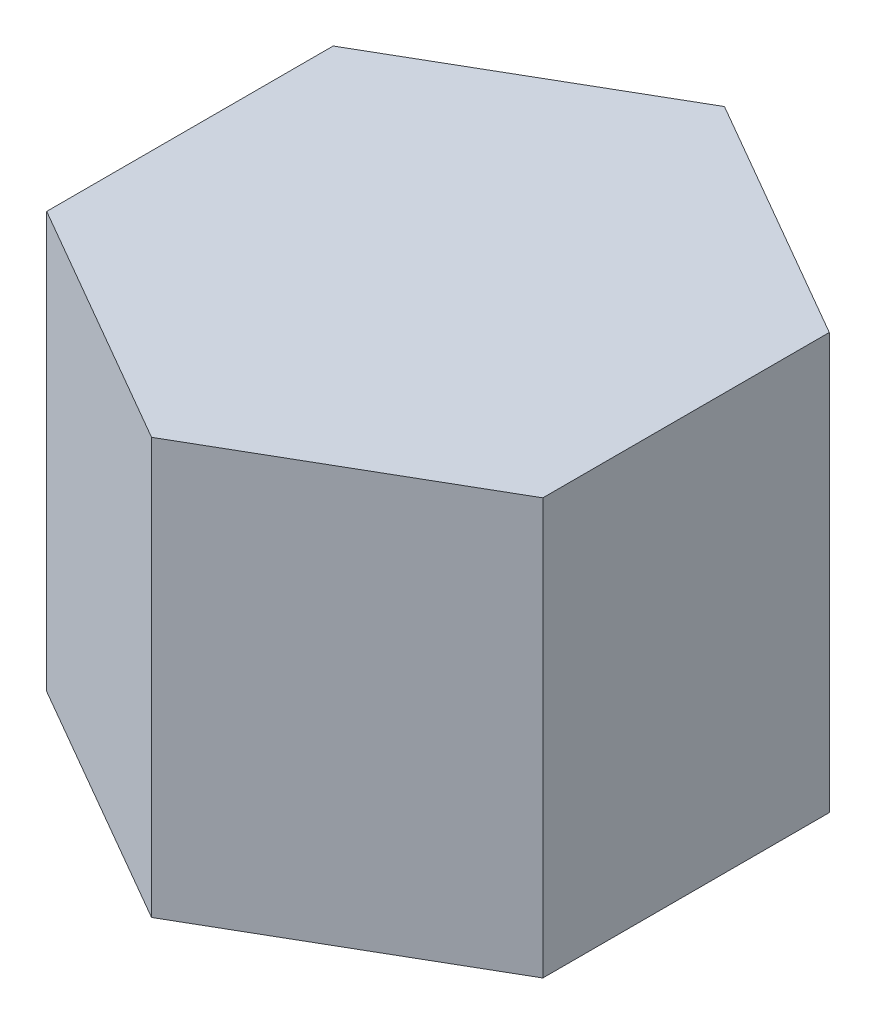
ISO-10303-21;
HEADER;
FILE_DESCRIPTION(('STEP AP214'),'2;1');
FILE_NAME('part.step','',(''),(''),'','','');
FILE_SCHEMA(('AUTOMOTIVE_DESIGN { 1 0 10303 214 1 1 1 1 }'));
ENDSEC;
DATA;
#1=APPLICATION_CONTEXT('core data for automotive mechanical design processes');
#2=APPLICATION_PROTOCOL_DEFINITION('international standard','automotive_design',2000,#1);
#3=PRODUCT_CONTEXT('',#1,'mechanical');
#4=PRODUCT('Part','Part','',(#3));
#5=PRODUCT_RELATED_PRODUCT_CATEGORY('part','',(#4));
#6=PRODUCT_DEFINITION_FORMATION('','',#4);
#7=PRODUCT_DEFINITION_CONTEXT('part definition',#1,'design');
#8=PRODUCT_DEFINITION('design','',#6,#7);
#9=PRODUCT_DEFINITION_SHAPE('','',#8);
#10=(LENGTH_UNIT() NAMED_UNIT(*) SI_UNIT(.MILLI.,.METRE.));
#11=(NAMED_UNIT(*) PLANE_ANGLE_UNIT() SI_UNIT($,.RADIAN.));
#12=(NAMED_UNIT(*) SI_UNIT($,.STERADIAN.) SOLID_ANGLE_UNIT());
#13=UNCERTAINTY_MEASURE_WITH_UNIT(LENGTH_MEASURE(1.E-05),#10,'distance_accuracy_value','');
#14=(GEOMETRIC_REPRESENTATION_CONTEXT(3) GLOBAL_UNCERTAINTY_ASSIGNED_CONTEXT((#13)) GLOBAL_UNIT_ASSIGNED_CONTEXT((#10,
#11,#12)) REPRESENTATION_CONTEXT('',''));
#15=CARTESIAN_POINT('',(0.,0.,0.));
#16=DIRECTION('',(0.,0.,1.));
#17=DIRECTION('',(1.,0.,0.));
#18=AXIS2_PLACEMENT_3D('',#15,#16,#17);
#19=CARTESIAN_POINT('',(211.142660308706,-148.537700895744,287.176844201572));
#20=DIRECTION('',(-0.499999999999943,0.,-0.866025403784472));
#21=DIRECTION('',(-0.866025403784472,0.,0.499999999999943));
#22=AXIS2_PLACEMENT_3D('',#19,#20,#21);
#23=PLANE('',#22);
#24=CARTESIAN_POINT('',(210.839551417382,-149.045793579175,287.351844201572));
#25=DIRECTION('',(0.866025403784471,0.,-0.499999999999943));
#26=VECTOR('',#25,1.);
#27=LINE('',#24,#26);
#28=CARTESIAN_POINT('',(210.839551417382,-149.045793579175,287.351844201572));
#29=VERTEX_POINT('',#28);
#30=CARTESIAN_POINT('',(211.142660308706,-149.045793579175,287.176844201572));
#31=VERTEX_POINT('',#30);
#32=EDGE_CURVE('E170',#29,#31,#27,.T.);
#33=ORIENTED_EDGE('',*,*,#32,.T.);
#34=CARTESIAN_POINT('',(211.142660308706,-148.537700895744,287.176844201572));
#35=DIRECTION('',(0.,-1.,0.));
#36=VECTOR('',#35,1.);
#37=LINE('',#34,#36);
#38=CARTESIAN_POINT('',(211.142660308706,-148.537700895744,287.176844201572));
#39=VERTEX_POINT('',#38);
#40=EDGE_CURVE('E35',#39,#31,#37,.T.);
#41=ORIENTED_EDGE('',*,*,#40,.F.);
#42=CARTESIAN_POINT('',(210.839551417382,-148.537700895744,287.351844201572));
#43=DIRECTION('',(0.866025403784471,0.,-0.499999999999943));
#44=VECTOR('',#43,1.);
#45=LINE('',#42,#44);
#46=CARTESIAN_POINT('',(210.839551417382,-148.537700895744,287.351844201572));
#47=VERTEX_POINT('',#46);
#48=EDGE_CURVE('E159',#47,#39,#45,.T.);
#49=ORIENTED_EDGE('',*,*,#48,.F.);
#50=CARTESIAN_POINT('',(210.839551417382,-148.537700895744,287.351844201572));
#51=DIRECTION('',(0.,-1.,0.));
#52=VECTOR('',#51,1.);
#53=LINE('',#50,#52);
#54=EDGE_CURVE('E10',#47,#29,#53,.T.);
#55=ORIENTED_EDGE('',*,*,#54,.T.);
#56=EDGE_LOOP('',(#33,#41,#49,#55));
#57=FACE_BOUND('',#56,.T.);
#58=ADVANCED_FACE('F16',(#57),#23,.F.);
#59=CARTESIAN_POINT('',(210.839551417382,-148.537700895744,287.351844201572));
#60=DIRECTION('',(0.500000000000062,0.,-0.866025403784403));
#61=DIRECTION('',(-0.866025403784403,0.,-0.500000000000062));
#62=AXIS2_PLACEMENT_3D('',#59,#60,#61);
#63=PLANE('',#62);
#64=CARTESIAN_POINT('',(210.536442526057,-149.045793579175,287.176844201572));
#65=DIRECTION('',(0.866025403784403,0.,0.500000000000062));
#66=VECTOR('',#65,1.);
#67=LINE('',#64,#66);
#68=CARTESIAN_POINT('',(210.536442526057,-149.045793579175,287.176844201572));
#69=VERTEX_POINT('',#68);
#70=EDGE_CURVE('E167',#69,#29,#67,.T.);
#71=ORIENTED_EDGE('',*,*,#70,.T.);
#72=ORIENTED_EDGE('',*,*,#54,.F.);
#73=CARTESIAN_POINT('',(210.536442526057,-148.537700895744,287.176844201572));
#74=DIRECTION('',(0.866025403784403,0.,0.500000000000062));
#75=VECTOR('',#74,1.);
#76=LINE('',#73,#75);
#77=CARTESIAN_POINT('',(210.536442526057,-148.537700895744,287.176844201572));
#78=VERTEX_POINT('',#77);
#79=EDGE_CURVE('E156',#78,#47,#76,.T.);
#80=ORIENTED_EDGE('',*,*,#79,.F.);
#81=CARTESIAN_POINT('',(210.536442526057,-148.537700895744,287.176844201572));
#82=DIRECTION('',(0.,-1.,0.));
#83=VECTOR('',#82,1.);
#84=LINE('',#81,#83);
#85=EDGE_CURVE('E27',#78,#69,#84,.T.);
#86=ORIENTED_EDGE('',*,*,#85,.T.);
#87=EDGE_LOOP('',(#71,#72,#80,#86));
#88=FACE_BOUND('',#87,.T.);
#89=ADVANCED_FACE('F189',(#88),#63,.F.);
#90=CARTESIAN_POINT('',(210.536442526057,-148.537700895744,290.831971220494));
#91=DIRECTION('',(1.,0.,0.));
#92=DIRECTION('',(0.,1.,0.));
#93=AXIS2_PLACEMENT_3D('',#90,#91,#92);
#94=PLANE('',#93);
#95=CARTESIAN_POINT('',(210.536442526057,-149.045793579175,286.826844201572));
#96=DIRECTION('',(0.,0.,1.));
#97=VECTOR('',#96,1.);
#98=LINE('',#95,#97);
#99=CARTESIAN_POINT('',(210.536442526057,-149.045793579175,286.826844201572));
#100=VERTEX_POINT('',#99);
#101=EDGE_CURVE('E163',#100,#69,#98,.T.);
#102=ORIENTED_EDGE('',*,*,#101,.T.);
#103=ORIENTED_EDGE('',*,*,#85,.F.);
#104=CARTESIAN_POINT('',(210.536442526057,-148.537700895744,286.826844201572));
#105=DIRECTION('',(0.,0.,1.));
#106=VECTOR('',#105,1.);
#107=LINE('',#104,#106);
#108=CARTESIAN_POINT('',(210.536442526057,-148.537700895744,286.826844201572));
#109=VERTEX_POINT('',#108);
#110=EDGE_CURVE('E106',#109,#78,#107,.T.);
#111=ORIENTED_EDGE('',*,*,#110,.F.);
#112=CARTESIAN_POINT('',(210.536442526057,-148.537700895744,286.826844201572));
#113=DIRECTION('',(0.,-1.,0.));
#114=VECTOR('',#113,1.);
#115=LINE('',#112,#114);
#116=EDGE_CURVE('E94',#109,#100,#115,.T.);
#117=ORIENTED_EDGE('',*,*,#116,.T.);
#118=EDGE_LOOP('',(#102,#103,#111,#117));
#119=FACE_BOUND('',#118,.T.);
#120=ADVANCED_FACE('F198',(#119),#94,.F.);
#121=CARTESIAN_POINT('',(210.536442526057,-148.537700895744,286.826844201572));
#122=DIRECTION('',(0.499999999999978,0.,0.866025403784452));
#123=DIRECTION('',(0.866025403784452,0.,-0.499999999999978));
#124=AXIS2_PLACEMENT_3D('',#121,#122,#123);
#125=PLANE('',#124);
#126=CARTESIAN_POINT('',(210.839551417382,-149.045793579175,286.651844201572));
#127=DIRECTION('',(-0.866025403784452,0.,0.499999999999978));
#128=VECTOR('',#127,1.);
#129=LINE('',#126,#128);
#130=CARTESIAN_POINT('',(210.839551417382,-149.045793579175,286.651844201572));
#131=VERTEX_POINT('',#130);
#132=EDGE_CURVE('E162',#131,#100,#129,.T.);
#133=ORIENTED_EDGE('',*,*,#132,.T.);
#134=ORIENTED_EDGE('',*,*,#116,.F.);
#135=CARTESIAN_POINT('',(210.839551417382,-148.537700895744,286.651844201572));
#136=DIRECTION('',(-0.866025403784452,0.,0.499999999999978));
#137=VECTOR('',#136,1.);
#138=LINE('',#135,#137);
#139=CARTESIAN_POINT('',(210.839551417382,-148.537700895744,286.651844201572));
#140=VERTEX_POINT('',#139);
#141=EDGE_CURVE('E98',#140,#109,#138,.T.);
#142=ORIENTED_EDGE('',*,*,#141,.F.);
#143=CARTESIAN_POINT('',(210.839551417382,-148.537700895744,286.651844201572));
#144=DIRECTION('',(0.,-1.,0.));
#145=VECTOR('',#144,1.);
#146=LINE('',#143,#145);
#147=EDGE_CURVE('E79',#140,#131,#146,.T.);
#148=ORIENTED_EDGE('',*,*,#147,.T.);
#149=EDGE_LOOP('',(#133,#134,#142,#148));
#150=FACE_BOUND('',#149,.T.);
#151=ADVANCED_FACE('F100',(#150),#125,.F.);
#152=CARTESIAN_POINT('',(210.839551417382,-148.537700895744,286.651844201572));
#153=DIRECTION('',(-0.499999999999943,0.,0.866025403784472));
#154=DIRECTION('',(0.866025403784472,0.,0.499999999999943));
#155=AXIS2_PLACEMENT_3D('',#152,#153,#154);
#156=PLANE('',#155);
#157=CARTESIAN_POINT('',(211.142660308706,-149.045793579175,286.826844201572));
#158=DIRECTION('',(-0.866025403784471,0.,-0.499999999999943));
#159=VECTOR('',#158,1.);
#160=LINE('',#157,#159);
#161=CARTESIAN_POINT('',(211.142660308706,-149.045793579175,286.826844201572));
#162=VERTEX_POINT('',#161);
#163=EDGE_CURVE('E88',#162,#131,#160,.T.);
#164=ORIENTED_EDGE('',*,*,#163,.T.);
#165=ORIENTED_EDGE('',*,*,#147,.F.);
#166=CARTESIAN_POINT('',(211.142660308706,-148.537700895744,286.826844201572));
#167=DIRECTION('',(-0.866025403784471,0.,-0.499999999999943));
#168=VECTOR('',#167,1.);
#169=LINE('',#166,#168);
#170=CARTESIAN_POINT('',(211.142660308706,-148.537700895744,286.826844201572));
#171=VERTEX_POINT('',#170);
#172=EDGE_CURVE('E84',#171,#140,#169,.T.);
#173=ORIENTED_EDGE('',*,*,#172,.F.);
#174=CARTESIAN_POINT('',(211.142660308706,-148.537700895744,286.826844201572));
#175=DIRECTION('',(0.,-1.,0.));
#176=VECTOR('',#175,1.);
#177=LINE('',#174,#176);
#178=EDGE_CURVE('E58',#171,#162,#177,.T.);
#179=ORIENTED_EDGE('',*,*,#178,.T.);
#180=EDGE_LOOP('',(#164,#165,#173,#179));
#181=FACE_BOUND('',#180,.T.);
#182=ADVANCED_FACE('F82',(#181),#156,.F.);
#183=CARTESIAN_POINT('',(211.142660308706,-148.537700895744,290.831971220494));
#184=DIRECTION('',(-1.,0.,0.));
#185=DIRECTION('',(0.,-1.,0.));
#186=AXIS2_PLACEMENT_3D('',#183,#184,#185);
#187=PLANE('',#186);
#188=CARTESIAN_POINT('',(211.142660308706,-149.045793579175,287.176844201572));
#189=DIRECTION('',(0.,0.,-1.));
#190=VECTOR('',#189,1.);
#191=LINE('',#188,#190);
#192=EDGE_CURVE('E160',#31,#162,#191,.T.);
#193=ORIENTED_EDGE('',*,*,#192,.T.);
#194=ORIENTED_EDGE('',*,*,#178,.F.);
#195=CARTESIAN_POINT('',(211.142660308706,-148.537700895744,287.176844201572));
#196=DIRECTION('',(0.,0.,-1.));
#197=VECTOR('',#196,1.);
#198=LINE('',#195,#197);
#199=EDGE_CURVE('E112',#39,#171,#198,.T.);
#200=ORIENTED_EDGE('',*,*,#199,.F.);
#201=ORIENTED_EDGE('',*,*,#40,.T.);
#202=EDGE_LOOP('',(#193,#194,#200,#201));
#203=FACE_BOUND('',#202,.T.);
#204=ADVANCED_FACE('F131',(#203),#187,.F.);
#205=CARTESIAN_POINT('',(206.339551417382,-148.537700895744,290.831971220494));
#206=DIRECTION('',(0.,-1.,0.));
#207=DIRECTION('',(1.,0.,0.));
#208=AXIS2_PLACEMENT_3D('',#205,#206,#207);
#209=PLANE('',#208);
#210=ORIENTED_EDGE('',*,*,#48,.T.);
#211=ORIENTED_EDGE('',*,*,#199,.T.);
#212=ORIENTED_EDGE('',*,*,#172,.T.);
#213=ORIENTED_EDGE('',*,*,#141,.T.);
#214=ORIENTED_EDGE('',*,*,#110,.T.);
#215=ORIENTED_EDGE('',*,*,#79,.T.);
#216=EDGE_LOOP('',(#210,#211,#212,#213,#214,#215));
#217=FACE_BOUND('',#216,.T.);
#218=ADVANCED_FACE('F111',(#217),#209,.F.);
#219=CARTESIAN_POINT('',(206.339551417382,-149.045793579175,290.831971220494));
#220=DIRECTION('',(0.,-1.,0.));
#221=DIRECTION('',(1.,0.,0.));
#222=AXIS2_PLACEMENT_3D('',#219,#220,#221);
#223=PLANE('',#222);
#224=ORIENTED_EDGE('',*,*,#32,.F.);
#225=ORIENTED_EDGE('',*,*,#70,.F.);
#226=ORIENTED_EDGE('',*,*,#101,.F.);
#227=ORIENTED_EDGE('',*,*,#132,.F.);
#228=ORIENTED_EDGE('',*,*,#163,.F.);
#229=ORIENTED_EDGE('',*,*,#192,.F.);
#230=EDGE_LOOP('',(#224,#225,#226,#227,#228,#229));
#231=FACE_BOUND('',#230,.T.);
#232=ADVANCED_FACE('F130',(#231),#223,.T.);
#233=CLOSED_SHELL('',(#58,#89,#120,#151,#182,#204,#218,#232));
#234=MANIFOLD_SOLID_BREP('B1',#233);
#235=ADVANCED_BREP_SHAPE_REPRESENTATION('',(#18,#234),#14);
#236=SHAPE_DEFINITION_REPRESENTATION(#9,#235);
ENDSEC;
END-ISO-10303-21;
